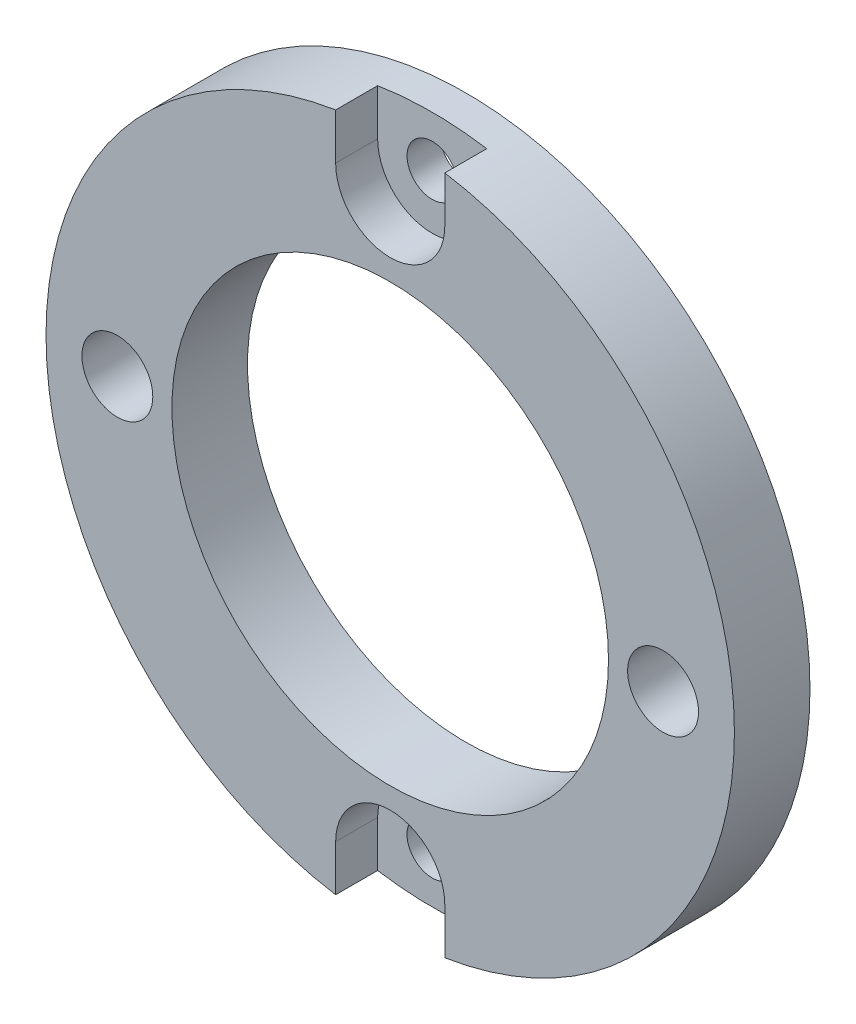
ISO-10303-21;
HEADER;
FILE_DESCRIPTION(('STEP AP214'),'2;1');
FILE_NAME('part.step','',(''),(''),'','','');
FILE_SCHEMA(('AUTOMOTIVE_DESIGN { 1 0 10303 214 1 1 1 1 }'));
ENDSEC;
DATA;
#1=APPLICATION_CONTEXT('core data for automotive mechanical design processes');
#2=APPLICATION_PROTOCOL_DEFINITION('international standard','automotive_design',2000,#1);
#3=PRODUCT_CONTEXT('',#1,'mechanical');
#4=PRODUCT('Part','Part','',(#3));
#5=PRODUCT_RELATED_PRODUCT_CATEGORY('part','',(#4));
#6=PRODUCT_DEFINITION_FORMATION('','',#4);
#7=PRODUCT_DEFINITION_CONTEXT('part definition',#1,'design');
#8=PRODUCT_DEFINITION('design','',#6,#7);
#9=PRODUCT_DEFINITION_SHAPE('','',#8);
#10=(LENGTH_UNIT() NAMED_UNIT(*) SI_UNIT(.MILLI.,.METRE.));
#11=(NAMED_UNIT(*) PLANE_ANGLE_UNIT() SI_UNIT($,.RADIAN.));
#12=(NAMED_UNIT(*) SI_UNIT($,.STERADIAN.) SOLID_ANGLE_UNIT());
#13=UNCERTAINTY_MEASURE_WITH_UNIT(LENGTH_MEASURE(1.E-05),#10,'distance_accuracy_value','');
#14=(GEOMETRIC_REPRESENTATION_CONTEXT(3) GLOBAL_UNCERTAINTY_ASSIGNED_CONTEXT((#13)) GLOBAL_UNIT_ASSIGNED_CONTEXT((#10,
#11,#12)) REPRESENTATION_CONTEXT('',''));
#15=CARTESIAN_POINT('',(0.,0.,0.));
#16=DIRECTION('',(0.,0.,1.));
#17=DIRECTION('',(1.,0.,0.));
#18=AXIS2_PLACEMENT_3D('',#15,#16,#17);
#19=CARTESIAN_POINT('',(0.,17.5,-0.00100000000000013));
#20=DIRECTION('',(0.,0.,1.));
#21=DIRECTION('',(1.,0.,0.));
#22=AXIS2_PLACEMENT_3D('',#19,#20,#21);
#23=CYLINDRICAL_SURFACE('',#22,1.5);
#24=CARTESIAN_POINT('',(0.,17.5,0.));
#25=DIRECTION('',(0.,0.,1.));
#26=DIRECTION('',(1.,0.,0.));
#27=AXIS2_PLACEMENT_3D('',#24,#25,#26);
#28=CIRCLE('',#27,1.5);
#29=CARTESIAN_POINT('',(1.5,17.5,0.));
#30=VERTEX_POINT('',#29);
#31=EDGE_CURVE('E166',#30,#30,#28,.F.);
#32=ORIENTED_EDGE('',*,*,#31,.T.);
#33=EDGE_LOOP('',(#32));
#34=FACE_BOUND('',#33,.T.);
#35=CARTESIAN_POINT('',(0.,17.5,2.));
#36=DIRECTION('',(0.,0.,1.));
#37=DIRECTION('',(1.,0.,0.));
#38=AXIS2_PLACEMENT_3D('',#35,#36,#37);
#39=CIRCLE('',#38,1.5);
#40=CARTESIAN_POINT('',(1.5,17.5,2.));
#41=VERTEX_POINT('',#40);
#42=EDGE_CURVE('E147',#41,#41,#39,.F.);
#43=ORIENTED_EDGE('',*,*,#42,.F.);
#44=EDGE_LOOP('',(#43));
#45=FACE_BOUND('',#44,.T.);
#46=ADVANCED_FACE('F33',(#34,#45),#23,.F.);
#47=CARTESIAN_POINT('',(0.,0.,4.5));
#48=DIRECTION('',(0.,0.,1.));
#49=DIRECTION('',(1.,0.,0.));
#50=AXIS2_PLACEMENT_3D('',#47,#48,#49);
#51=PLANE('',#50);
#52=DIRECTION('',(0.,-1.,0.));
#53=VECTOR('',#52,1.);
#54=CARTESIAN_POINT('',(-3.25,-17.5,4.5));
#55=LINE('',#54,#53);
#56=CARTESIAN_POINT('',(-3.25,-17.5,4.5));
#57=VERTEX_POINT('',#56);
#58=CARTESIAN_POINT('',(-3.25,-20.2407386228863,4.5));
#59=VERTEX_POINT('',#58);
#60=EDGE_CURVE('E122',#57,#59,#55,.T.);
#61=ORIENTED_EDGE('',*,*,#60,.F.);
#62=CARTESIAN_POINT('',(0.,-17.5,4.5));
#63=DIRECTION('',(0.,0.,1.));
#64=DIRECTION('',(-1.,0.,0.));
#65=AXIS2_PLACEMENT_3D('',#62,#63,#64);
#66=CIRCLE('',#65,3.25);
#67=CARTESIAN_POINT('',(3.25,-17.5,4.5));
#68=VERTEX_POINT('',#67);
#69=EDGE_CURVE('E125',#68,#57,#66,.T.);
#70=ORIENTED_EDGE('',*,*,#69,.F.);
#71=DIRECTION('',(0.,1.,0.));
#72=VECTOR('',#71,1.);
#73=CARTESIAN_POINT('',(3.25,-27.5,4.5));
#74=LINE('',#73,#72);
#75=CARTESIAN_POINT('',(3.25,-20.2407386228863,4.5));
#76=VERTEX_POINT('',#75);
#77=EDGE_CURVE('E112',#76,#68,#74,.T.);
#78=ORIENTED_EDGE('',*,*,#77,.F.);
#79=CARTESIAN_POINT('',(0.,0.,4.5));
#80=DIRECTION('',(0.,0.,1.));
#81=DIRECTION('',(1.,0.,0.));
#82=AXIS2_PLACEMENT_3D('',#79,#80,#81);
#83=CIRCLE('',#82,20.5);
#84=CARTESIAN_POINT('',(3.25,20.2407386228863,4.5));
#85=VERTEX_POINT('',#84);
#86=EDGE_CURVE('E180',#76,#85,#83,.T.);
#87=ORIENTED_EDGE('',*,*,#86,.T.);
#88=DIRECTION('',(0.,1.,0.));
#89=VECTOR('',#88,1.);
#90=CARTESIAN_POINT('',(3.25,27.5,4.5));
#91=LINE('',#90,#89);
#92=CARTESIAN_POINT('',(3.25,17.5,4.5));
#93=VERTEX_POINT('',#92);
#94=EDGE_CURVE('E140',#93,#85,#91,.T.);
#95=ORIENTED_EDGE('',*,*,#94,.F.);
#96=CARTESIAN_POINT('',(0.,17.5,4.5));
#97=DIRECTION('',(0.,0.,1.));
#98=DIRECTION('',(1.,0.,0.));
#99=AXIS2_PLACEMENT_3D('',#96,#97,#98);
#100=CIRCLE('',#99,3.25);
#101=CARTESIAN_POINT('',(-3.25,17.5,4.5));
#102=VERTEX_POINT('',#101);
#103=EDGE_CURVE('E130',#102,#93,#100,.T.);
#104=ORIENTED_EDGE('',*,*,#103,.F.);
#105=DIRECTION('',(0.,-1.,0.));
#106=VECTOR('',#105,1.);
#107=CARTESIAN_POINT('',(-3.25,17.5,4.5));
#108=LINE('',#107,#106);
#109=CARTESIAN_POINT('',(-3.25,20.2407386228863,4.5));
#110=VERTEX_POINT('',#109);
#111=EDGE_CURVE('E133',#110,#102,#108,.T.);
#112=ORIENTED_EDGE('',*,*,#111,.F.);
#113=EDGE_CURVE('E176',#110,#59,#83,.T.);
#114=ORIENTED_EDGE('',*,*,#113,.T.);
#115=EDGE_LOOP('',(#61,#70,#78,#87,#95,#104,#112,#114));
#116=FACE_BOUND('',#115,.T.);
#117=CARTESIAN_POINT('',(-16.25,0.,4.5));
#118=DIRECTION('',(0.,0.,1.));
#119=DIRECTION('',(-1.,0.,0.));
#120=AXIS2_PLACEMENT_3D('',#117,#118,#119);
#121=CIRCLE('',#120,2.11);
#122=CARTESIAN_POINT('',(-18.36,0.,4.5));
#123=VERTEX_POINT('',#122);
#124=EDGE_CURVE('E151',#123,#123,#121,.T.);
#125=ORIENTED_EDGE('',*,*,#124,.F.);
#126=EDGE_LOOP('',(#125));
#127=FACE_BOUND('',#126,.T.);
#128=CARTESIAN_POINT('',(16.25,0.,4.5));
#129=DIRECTION('',(0.,0.,1.));
#130=DIRECTION('',(1.,0.,0.));
#131=AXIS2_PLACEMENT_3D('',#128,#129,#130);
#132=CIRCLE('',#131,2.11);
#133=CARTESIAN_POINT('',(18.36,0.,4.5));
#134=VERTEX_POINT('',#133);
#135=EDGE_CURVE('E160',#134,#134,#132,.T.);
#136=ORIENTED_EDGE('',*,*,#135,.F.);
#137=EDGE_LOOP('',(#136));
#138=FACE_BOUND('',#137,.T.);
#139=CARTESIAN_POINT('',(0.,0.,4.5));
#140=DIRECTION('',(0.,0.,1.));
#141=DIRECTION('',(1.,0.,0.));
#142=AXIS2_PLACEMENT_3D('',#139,#140,#141);
#143=CIRCLE('',#142,13.);
#144=CARTESIAN_POINT('',(13.,0.,4.5));
#145=VERTEX_POINT('',#144);
#146=EDGE_CURVE('E170',#145,#145,#143,.T.);
#147=ORIENTED_EDGE('',*,*,#146,.F.);
#148=EDGE_LOOP('',(#147));
#149=FACE_BOUND('',#148,.T.);
#150=ADVANCED_FACE('F196',(#116,#127,#138,#149),#51,.T.);
#151=CARTESIAN_POINT('',(0.,0.,0.));
#152=DIRECTION('',(0.,0.,1.));
#153=DIRECTION('',(1.,0.,0.));
#154=AXIS2_PLACEMENT_3D('',#151,#152,#153);
#155=PLANE('',#154);
#156=CARTESIAN_POINT('',(-16.25,0.,0.));
#157=DIRECTION('',(0.,0.,1.));
#158=DIRECTION('',(1.,0.,0.));
#159=AXIS2_PLACEMENT_3D('',#156,#157,#158);
#160=CIRCLE('',#159,2.11);
#161=CARTESIAN_POINT('',(-14.14,0.,0.));
#162=VERTEX_POINT('',#161);
#163=EDGE_CURVE('E154',#162,#162,#160,.F.);
#164=ORIENTED_EDGE('',*,*,#163,.F.);
#165=EDGE_LOOP('',(#164));
#166=FACE_BOUND('',#165,.T.);
#167=CARTESIAN_POINT('',(0.,-17.5,0.));
#168=DIRECTION('',(0.,0.,1.));
#169=DIRECTION('',(1.,0.,0.));
#170=AXIS2_PLACEMENT_3D('',#167,#168,#169);
#171=CIRCLE('',#170,1.5);
#172=CARTESIAN_POINT('',(1.5,-17.5,0.));
#173=VERTEX_POINT('',#172);
#174=EDGE_CURVE('E157',#173,#173,#171,.F.);
#175=ORIENTED_EDGE('',*,*,#174,.F.);
#176=EDGE_LOOP('',(#175));
#177=FACE_BOUND('',#176,.T.);
#178=CARTESIAN_POINT('',(16.25,0.,0.));
#179=DIRECTION('',(0.,0.,1.));
#180=DIRECTION('',(1.,0.,0.));
#181=AXIS2_PLACEMENT_3D('',#178,#179,#180);
#182=CIRCLE('',#181,2.11);
#183=CARTESIAN_POINT('',(18.36,0.,0.));
#184=VERTEX_POINT('',#183);
#185=EDGE_CURVE('E163',#184,#184,#182,.F.);
#186=ORIENTED_EDGE('',*,*,#185,.F.);
#187=EDGE_LOOP('',(#186));
#188=FACE_BOUND('',#187,.T.);
#189=ORIENTED_EDGE('',*,*,#31,.F.);
#190=EDGE_LOOP('',(#189));
#191=FACE_BOUND('',#190,.T.);
#192=CARTESIAN_POINT('',(0.,0.,0.));
#193=DIRECTION('',(0.,0.,1.));
#194=DIRECTION('',(1.,0.,0.));
#195=AXIS2_PLACEMENT_3D('',#192,#193,#194);
#196=CIRCLE('',#195,20.5);
#197=CARTESIAN_POINT('',(20.5,0.,0.));
#198=VERTEX_POINT('',#197);
#199=EDGE_CURVE('E173',#198,#198,#196,.T.);
#200=ORIENTED_EDGE('',*,*,#199,.F.);
#201=EDGE_LOOP('',(#200));
#202=FACE_BOUND('',#201,.T.);
#203=CARTESIAN_POINT('',(0.,0.,0.));
#204=DIRECTION('',(0.,0.,1.));
#205=DIRECTION('',(1.,0.,0.));
#206=AXIS2_PLACEMENT_3D('',#203,#204,#205);
#207=CIRCLE('',#206,13.);
#208=CARTESIAN_POINT('',(13.,0.,0.));
#209=VERTEX_POINT('',#208);
#210=EDGE_CURVE('E169',#209,#209,#207,.T.);
#211=ORIENTED_EDGE('',*,*,#210,.T.);
#212=EDGE_LOOP('',(#211));
#213=FACE_BOUND('',#212,.T.);
#214=ADVANCED_FACE('F232',(#166,#177,#188,#191,#202,#213),#155,.F.);
#215=CARTESIAN_POINT('',(0.,0.,4.5));
#216=DIRECTION('',(0.,0.,-1.));
#217=DIRECTION('',(-1.,0.,0.));
#218=AXIS2_PLACEMENT_3D('',#215,#216,#217);
#219=CYLINDRICAL_SURFACE('',#218,20.5);
#220=CARTESIAN_POINT('',(0.,0.,2.));
#221=DIRECTION('',(0.,0.,-1.));
#222=DIRECTION('',(-1.,0.,0.));
#223=AXIS2_PLACEMENT_3D('',#220,#221,#222);
#224=CIRCLE('',#223,20.5);
#225=CARTESIAN_POINT('',(3.25,-20.2407386228863,2.));
#226=VERTEX_POINT('',#225);
#227=CARTESIAN_POINT('',(-3.25,-20.2407386228863,2.));
#228=VERTEX_POINT('',#227);
#229=EDGE_CURVE('E104',#226,#228,#224,.T.);
#230=ORIENTED_EDGE('',*,*,#229,.T.);
#231=DIRECTION('',(0.,0.,-1.));
#232=VECTOR('',#231,1.);
#233=CARTESIAN_POINT('',(-3.25,-20.2407386228863,4.5));
#234=LINE('',#233,#232);
#235=EDGE_CURVE('E11',#228,#59,#234,.F.);
#236=ORIENTED_EDGE('',*,*,#235,.T.);
#237=ORIENTED_EDGE('',*,*,#113,.F.);
#238=DIRECTION('',(0.,0.,-1.));
#239=VECTOR('',#238,1.);
#240=CARTESIAN_POINT('',(-3.25,20.2407386228863,4.5));
#241=LINE('',#240,#239);
#242=CARTESIAN_POINT('',(-3.25,20.2407386228863,2.));
#243=VERTEX_POINT('',#242);
#244=EDGE_CURVE('E187',#110,#243,#241,.T.);
#245=ORIENTED_EDGE('',*,*,#244,.T.);
#246=CARTESIAN_POINT('',(0.,0.,2.));
#247=DIRECTION('',(0.,0.,1.));
#248=DIRECTION('',(1.,0.,0.));
#249=AXIS2_PLACEMENT_3D('',#246,#247,#248);
#250=CIRCLE('',#249,20.5);
#251=CARTESIAN_POINT('',(3.25,20.2407386228863,2.));
#252=VERTEX_POINT('',#251);
#253=EDGE_CURVE('E149',#252,#243,#250,.T.);
#254=ORIENTED_EDGE('',*,*,#253,.F.);
#255=DIRECTION('',(0.,0.,-1.));
#256=VECTOR('',#255,1.);
#257=CARTESIAN_POINT('',(3.25,20.2407386228863,4.5));
#258=LINE('',#257,#256);
#259=EDGE_CURVE('E179',#252,#85,#258,.F.);
#260=ORIENTED_EDGE('',*,*,#259,.T.);
#261=ORIENTED_EDGE('',*,*,#86,.F.);
#262=DIRECTION('',(0.,0.,-1.));
#263=VECTOR('',#262,1.);
#264=CARTESIAN_POINT('',(3.25,-20.2407386228863,4.5));
#265=LINE('',#264,#263);
#266=EDGE_CURVE('E41',#76,#226,#265,.T.);
#267=ORIENTED_EDGE('',*,*,#266,.T.);
#268=EDGE_LOOP('',(#230,#236,#237,#245,#254,#260,#261,#267));
#269=FACE_BOUND('',#268,.T.);
#270=ORIENTED_EDGE('',*,*,#199,.T.);
#271=EDGE_LOOP('',(#270));
#272=FACE_BOUND('',#271,.T.);
#273=ADVANCED_FACE('F35',(#269,#272),#219,.T.);
#274=CARTESIAN_POINT('',(0.,0.,4.5));
#275=DIRECTION('',(0.,0.,-1.));
#276=DIRECTION('',(-1.,0.,0.));
#277=AXIS2_PLACEMENT_3D('',#274,#275,#276);
#278=CYLINDRICAL_SURFACE('',#277,13.);
#279=ORIENTED_EDGE('',*,*,#146,.T.);
#280=EDGE_LOOP('',(#279));
#281=FACE_BOUND('',#280,.T.);
#282=ORIENTED_EDGE('',*,*,#210,.F.);
#283=EDGE_LOOP('',(#282));
#284=FACE_BOUND('',#283,.T.);
#285=ADVANCED_FACE('F239',(#281,#284),#278,.F.);
#286=CARTESIAN_POINT('',(16.25,0.,-0.00100000000000013));
#287=DIRECTION('',(0.,0.,1.));
#288=DIRECTION('',(1.,0.,0.));
#289=AXIS2_PLACEMENT_3D('',#286,#287,#288);
#290=CYLINDRICAL_SURFACE('',#289,2.11);
#291=ORIENTED_EDGE('',*,*,#135,.T.);
#292=EDGE_LOOP('',(#291));
#293=FACE_BOUND('',#292,.T.);
#294=ORIENTED_EDGE('',*,*,#185,.T.);
#295=EDGE_LOOP('',(#294));
#296=FACE_BOUND('',#295,.T.);
#297=ADVANCED_FACE('F237',(#293,#296),#290,.F.);
#298=CARTESIAN_POINT('',(0.,-17.5,-0.00100000000000013));
#299=DIRECTION('',(0.,0.,1.));
#300=DIRECTION('',(1.,0.,0.));
#301=AXIS2_PLACEMENT_3D('',#298,#299,#300);
#302=CYLINDRICAL_SURFACE('',#301,1.5);
#303=CARTESIAN_POINT('',(0.,-17.5,2.));
#304=DIRECTION('',(0.,0.,-1.));
#305=DIRECTION('',(-1.,0.,0.));
#306=AXIS2_PLACEMENT_3D('',#303,#304,#305);
#307=CIRCLE('',#306,1.5);
#308=CARTESIAN_POINT('',(-1.5,-17.5,2.));
#309=VERTEX_POINT('',#308);
#310=EDGE_CURVE('E127',#309,#309,#307,.F.);
#311=ORIENTED_EDGE('',*,*,#310,.T.);
#312=EDGE_LOOP('',(#311));
#313=FACE_BOUND('',#312,.T.);
#314=ORIENTED_EDGE('',*,*,#174,.T.);
#315=EDGE_LOOP('',(#314));
#316=FACE_BOUND('',#315,.T.);
#317=ADVANCED_FACE('F261',(#313,#316),#302,.F.);
#318=CARTESIAN_POINT('',(-16.25,0.,-0.00100000000000013));
#319=DIRECTION('',(0.,0.,1.));
#320=DIRECTION('',(1.,0.,0.));
#321=AXIS2_PLACEMENT_3D('',#318,#319,#320);
#322=CYLINDRICAL_SURFACE('',#321,2.11);
#323=ORIENTED_EDGE('',*,*,#124,.T.);
#324=EDGE_LOOP('',(#323));
#325=FACE_BOUND('',#324,.T.);
#326=ORIENTED_EDGE('',*,*,#163,.T.);
#327=EDGE_LOOP('',(#326));
#328=FACE_BOUND('',#327,.T.);
#329=ADVANCED_FACE('F266',(#325,#328),#322,.F.);
#330=CARTESIAN_POINT('',(-3.25,17.5,2.));
#331=DIRECTION('',(-1.,0.,0.));
#332=DIRECTION('',(0.,0.,1.));
#333=AXIS2_PLACEMENT_3D('',#330,#331,#332);
#334=PLANE('',#333);
#335=ORIENTED_EDGE('',*,*,#111,.T.);
#336=DIRECTION('',(0.,0.,1.));
#337=VECTOR('',#336,1.);
#338=CARTESIAN_POINT('',(-3.25,17.5,2.));
#339=LINE('',#338,#337);
#340=CARTESIAN_POINT('',(-3.25,17.5,2.));
#341=VERTEX_POINT('',#340);
#342=EDGE_CURVE('E144',#341,#102,#339,.T.);
#343=ORIENTED_EDGE('',*,*,#342,.F.);
#344=DIRECTION('',(0.,-1.,0.));
#345=VECTOR('',#344,1.);
#346=CARTESIAN_POINT('',(-3.25,17.5,2.));
#347=LINE('',#346,#345);
#348=EDGE_CURVE('E135',#243,#341,#347,.T.);
#349=ORIENTED_EDGE('',*,*,#348,.F.);
#350=ORIENTED_EDGE('',*,*,#244,.F.);
#351=EDGE_LOOP('',(#335,#343,#349,#350));
#352=FACE_BOUND('',#351,.T.);
#353=ADVANCED_FACE('F206',(#352),#334,.F.);
#354=CARTESIAN_POINT('',(3.25,27.5,2.));
#355=DIRECTION('',(1.,0.,0.));
#356=DIRECTION('',(0.,1.,0.));
#357=AXIS2_PLACEMENT_3D('',#354,#355,#356);
#358=PLANE('',#357);
#359=DIRECTION('',(0.,1.,0.));
#360=VECTOR('',#359,1.);
#361=CARTESIAN_POINT('',(3.25,27.5,2.));
#362=LINE('',#361,#360);
#363=CARTESIAN_POINT('',(3.25,17.5,2.));
#364=VERTEX_POINT('',#363);
#365=EDGE_CURVE('E56',#364,#252,#362,.T.);
#366=ORIENTED_EDGE('',*,*,#365,.F.);
#367=DIRECTION('',(0.,0.,1.));
#368=VECTOR('',#367,1.);
#369=CARTESIAN_POINT('',(3.25,17.5,2.));
#370=LINE('',#369,#368);
#371=EDGE_CURVE('E137',#364,#93,#370,.T.);
#372=ORIENTED_EDGE('',*,*,#371,.T.);
#373=ORIENTED_EDGE('',*,*,#94,.T.);
#374=ORIENTED_EDGE('',*,*,#259,.F.);
#375=EDGE_LOOP('',(#366,#372,#373,#374));
#376=FACE_BOUND('',#375,.T.);
#377=ADVANCED_FACE('F214',(#376),#358,.F.);
#378=CARTESIAN_POINT('',(0.,17.5,2.));
#379=DIRECTION('',(0.,0.,1.));
#380=DIRECTION('',(1.,0.,0.));
#381=AXIS2_PLACEMENT_3D('',#378,#379,#380);
#382=PLANE('',#381);
#383=ORIENTED_EDGE('',*,*,#42,.T.);
#384=EDGE_LOOP('',(#383));
#385=FACE_BOUND('',#384,.T.);
#386=ORIENTED_EDGE('',*,*,#253,.T.);
#387=ORIENTED_EDGE('',*,*,#348,.T.);
#388=CARTESIAN_POINT('',(0.,17.5,2.));
#389=DIRECTION('',(0.,0.,1.));
#390=DIRECTION('',(1.,0.,0.));
#391=AXIS2_PLACEMENT_3D('',#388,#389,#390);
#392=CIRCLE('',#391,3.25);
#393=EDGE_CURVE('E131',#341,#364,#392,.T.);
#394=ORIENTED_EDGE('',*,*,#393,.T.);
#395=ORIENTED_EDGE('',*,*,#365,.T.);
#396=EDGE_LOOP('',(#386,#387,#394,#395));
#397=FACE_BOUND('',#396,.T.);
#398=ADVANCED_FACE('F212',(#385,#397),#382,.T.);
#399=CARTESIAN_POINT('',(0.,17.5,2.));
#400=DIRECTION('',(0.,0.,1.));
#401=DIRECTION('',(1.,0.,0.));
#402=AXIS2_PLACEMENT_3D('',#399,#400,#401);
#403=CYLINDRICAL_SURFACE('',#402,3.25);
#404=ORIENTED_EDGE('',*,*,#103,.T.);
#405=ORIENTED_EDGE('',*,*,#371,.F.);
#406=ORIENTED_EDGE('',*,*,#393,.F.);
#407=ORIENTED_EDGE('',*,*,#342,.T.);
#408=EDGE_LOOP('',(#404,#405,#406,#407));
#409=FACE_BOUND('',#408,.T.);
#410=ADVANCED_FACE('F210',(#409),#403,.F.);
#411=CARTESIAN_POINT('',(-3.25,-17.5,2.));
#412=DIRECTION('',(-1.,0.,0.));
#413=DIRECTION('',(0.,0.,1.));
#414=AXIS2_PLACEMENT_3D('',#411,#412,#413);
#415=PLANE('',#414);
#416=DIRECTION('',(0.,-1.,0.));
#417=VECTOR('',#416,1.);
#418=CARTESIAN_POINT('',(-3.25,-17.5,2.));
#419=LINE('',#418,#417);
#420=CARTESIAN_POINT('',(-3.25,-17.5,2.));
#421=VERTEX_POINT('',#420);
#422=EDGE_CURVE('E48',#421,#228,#419,.T.);
#423=ORIENTED_EDGE('',*,*,#422,.F.);
#424=DIRECTION('',(0.,0.,1.));
#425=VECTOR('',#424,1.);
#426=CARTESIAN_POINT('',(-3.25,-17.5,2.));
#427=LINE('',#426,#425);
#428=EDGE_CURVE('E116',#421,#57,#427,.T.);
#429=ORIENTED_EDGE('',*,*,#428,.T.);
#430=ORIENTED_EDGE('',*,*,#60,.T.);
#431=ORIENTED_EDGE('',*,*,#235,.F.);
#432=EDGE_LOOP('',(#423,#429,#430,#431));
#433=FACE_BOUND('',#432,.T.);
#434=ADVANCED_FACE('F202',(#433),#415,.F.);
#435=CARTESIAN_POINT('',(3.25,-27.5,2.));
#436=DIRECTION('',(1.,0.,0.));
#437=DIRECTION('',(0.,1.,0.));
#438=AXIS2_PLACEMENT_3D('',#435,#436,#437);
#439=PLANE('',#438);
#440=ORIENTED_EDGE('',*,*,#77,.T.);
#441=DIRECTION('',(0.,0.,1.));
#442=VECTOR('',#441,1.);
#443=CARTESIAN_POINT('',(3.25,-17.5,2.));
#444=LINE('',#443,#442);
#445=CARTESIAN_POINT('',(3.25,-17.5,2.));
#446=VERTEX_POINT('',#445);
#447=EDGE_CURVE('E109',#446,#68,#444,.T.);
#448=ORIENTED_EDGE('',*,*,#447,.F.);
#449=DIRECTION('',(0.,1.,0.));
#450=VECTOR('',#449,1.);
#451=CARTESIAN_POINT('',(3.25,-27.5,2.));
#452=LINE('',#451,#450);
#453=EDGE_CURVE('E98',#226,#446,#452,.T.);
#454=ORIENTED_EDGE('',*,*,#453,.F.);
#455=ORIENTED_EDGE('',*,*,#266,.F.);
#456=EDGE_LOOP('',(#440,#448,#454,#455));
#457=FACE_BOUND('',#456,.T.);
#458=ADVANCED_FACE('F110',(#457),#439,.F.);
#459=CARTESIAN_POINT('',(0.,-17.5,2.));
#460=DIRECTION('',(0.,0.,-1.));
#461=DIRECTION('',(-1.,0.,0.));
#462=AXIS2_PLACEMENT_3D('',#459,#460,#461);
#463=PLANE('',#462);
#464=ORIENTED_EDGE('',*,*,#310,.F.);
#465=EDGE_LOOP('',(#464));
#466=FACE_BOUND('',#465,.T.);
#467=ORIENTED_EDGE('',*,*,#453,.T.);
#468=CARTESIAN_POINT('',(0.,-17.5,2.));
#469=DIRECTION('',(0.,0.,1.));
#470=DIRECTION('',(-1.,0.,0.));
#471=AXIS2_PLACEMENT_3D('',#468,#469,#470);
#472=CIRCLE('',#471,3.25);
#473=EDGE_CURVE('E102',#446,#421,#472,.T.);
#474=ORIENTED_EDGE('',*,*,#473,.T.);
#475=ORIENTED_EDGE('',*,*,#422,.T.);
#476=ORIENTED_EDGE('',*,*,#229,.F.);
#477=EDGE_LOOP('',(#467,#474,#475,#476));
#478=FACE_BOUND('',#477,.T.);
#479=ADVANCED_FACE('F100',(#466,#478),#463,.F.);
#480=CARTESIAN_POINT('',(0.,-17.5,2.));
#481=DIRECTION('',(0.,0.,1.));
#482=DIRECTION('',(1.,0.,0.));
#483=AXIS2_PLACEMENT_3D('',#480,#481,#482);
#484=CYLINDRICAL_SURFACE('',#483,3.25);
#485=ORIENTED_EDGE('',*,*,#69,.T.);
#486=ORIENTED_EDGE('',*,*,#428,.F.);
#487=ORIENTED_EDGE('',*,*,#473,.F.);
#488=ORIENTED_EDGE('',*,*,#447,.T.);
#489=EDGE_LOOP('',(#485,#486,#487,#488));
#490=FACE_BOUND('',#489,.T.);
#491=ADVANCED_FACE('F118',(#490),#484,.F.);
#492=CLOSED_SHELL('',(#46,#150,#214,#273,#285,#297,#317,#329,#353,#377,#398,#410,#434,#458,#479,#491));
#493=MANIFOLD_SOLID_BREP('B2',#492);
#494=ADVANCED_BREP_SHAPE_REPRESENTATION('',(#18,#493),#14);
#495=SHAPE_DEFINITION_REPRESENTATION(#9,#494);
ENDSEC;
END-ISO-10303-21;
